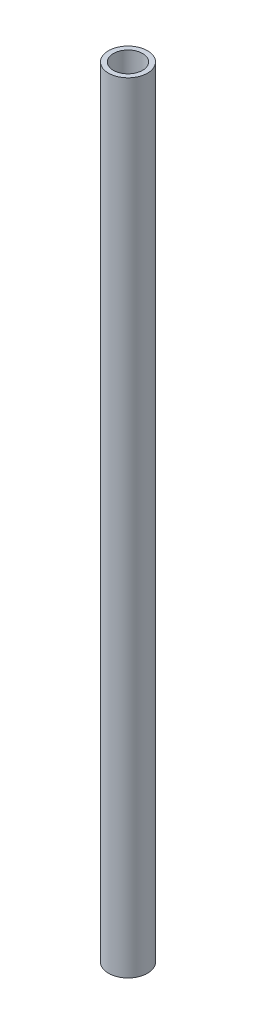
ISO-10303-21;
HEADER;
FILE_DESCRIPTION(('STEP AP214'),'2;1');
FILE_NAME('part.step','',(''),(''),'','','');
FILE_SCHEMA(('AUTOMOTIVE_DESIGN { 1 0 10303 214 1 1 1 1 }'));
ENDSEC;
DATA;
#1=APPLICATION_CONTEXT('core data for automotive mechanical design processes');
#2=APPLICATION_PROTOCOL_DEFINITION('international standard','automotive_design',2000,#1);
#3=PRODUCT_CONTEXT('',#1,'mechanical');
#4=PRODUCT('Part','Part','',(#3));
#5=PRODUCT_RELATED_PRODUCT_CATEGORY('part','',(#4));
#6=PRODUCT_DEFINITION_FORMATION('','',#4);
#7=PRODUCT_DEFINITION_CONTEXT('part definition',#1,'design');
#8=PRODUCT_DEFINITION('design','',#6,#7);
#9=PRODUCT_DEFINITION_SHAPE('','',#8);
#10=(LENGTH_UNIT() NAMED_UNIT(*) SI_UNIT(.MILLI.,.METRE.));
#11=(NAMED_UNIT(*) PLANE_ANGLE_UNIT() SI_UNIT($,.RADIAN.));
#12=(NAMED_UNIT(*) SI_UNIT($,.STERADIAN.) SOLID_ANGLE_UNIT());
#13=UNCERTAINTY_MEASURE_WITH_UNIT(LENGTH_MEASURE(1.E-05),#10,'distance_accuracy_value','');
#14=(GEOMETRIC_REPRESENTATION_CONTEXT(3) GLOBAL_UNCERTAINTY_ASSIGNED_CONTEXT((#13)) GLOBAL_UNIT_ASSIGNED_CONTEXT((#10,
#11,#12)) REPRESENTATION_CONTEXT('',''));
#15=CARTESIAN_POINT('',(0.,0.,0.));
#16=DIRECTION('',(0.,0.,1.));
#17=DIRECTION('',(1.,0.,0.));
#18=AXIS2_PLACEMENT_3D('',#15,#16,#17);
#19=CARTESIAN_POINT('',(0.,160.,0.));
#20=DIRECTION('',(0.,1.,0.));
#21=DIRECTION('',(0.,0.,1.));
#22=AXIS2_PLACEMENT_3D('',#19,#20,#21);
#23=PLANE('',#22);
#24=CARTESIAN_POINT('',(0.,160.,0.));
#25=DIRECTION('',(0.,1.,0.));
#26=DIRECTION('',(0.,0.,1.));
#27=AXIS2_PLACEMENT_3D('',#24,#25,#26);
#28=CIRCLE('',#27,4.);
#29=CARTESIAN_POINT('',(0.,160.,4.));
#30=VERTEX_POINT('',#29);
#31=EDGE_CURVE('E10',#30,#30,#28,.T.);
#32=ORIENTED_EDGE('',*,*,#31,.T.);
#33=EDGE_LOOP('',(#32));
#34=FACE_BOUND('',#33,.T.);
#35=CARTESIAN_POINT('',(0.,160.,0.));
#36=DIRECTION('',(0.,1.,0.));
#37=DIRECTION('',(0.,0.,1.));
#38=AXIS2_PLACEMENT_3D('',#35,#36,#37);
#39=CIRCLE('',#38,3.);
#40=CARTESIAN_POINT('',(0.,160.,3.));
#41=VERTEX_POINT('',#40);
#42=EDGE_CURVE('E42',#41,#41,#39,.T.);
#43=ORIENTED_EDGE('',*,*,#42,.F.);
#44=EDGE_LOOP('',(#43));
#45=FACE_BOUND('',#44,.T.);
#46=ADVANCED_FACE('F31',(#34,#45),#23,.T.);
#47=CARTESIAN_POINT('',(0.,0.,0.));
#48=DIRECTION('',(0.,1.,0.));
#49=DIRECTION('',(0.,0.,1.));
#50=AXIS2_PLACEMENT_3D('',#47,#48,#49);
#51=PLANE('',#50);
#52=CARTESIAN_POINT('',(0.,0.,0.));
#53=DIRECTION('',(0.,1.,0.));
#54=DIRECTION('',(0.,0.,1.));
#55=AXIS2_PLACEMENT_3D('',#52,#53,#54);
#56=CIRCLE('',#55,4.);
#57=CARTESIAN_POINT('',(0.,0.,4.));
#58=VERTEX_POINT('',#57);
#59=EDGE_CURVE('E35',#58,#58,#56,.T.);
#60=ORIENTED_EDGE('',*,*,#59,.F.);
#61=EDGE_LOOP('',(#60));
#62=FACE_BOUND('',#61,.T.);
#63=CARTESIAN_POINT('',(0.,0.,0.));
#64=DIRECTION('',(0.,1.,0.));
#65=DIRECTION('',(0.,0.,1.));
#66=AXIS2_PLACEMENT_3D('',#63,#64,#65);
#67=CIRCLE('',#66,3.);
#68=CARTESIAN_POINT('',(0.,0.,3.));
#69=VERTEX_POINT('',#68);
#70=EDGE_CURVE('E44',#69,#69,#67,.T.);
#71=ORIENTED_EDGE('',*,*,#70,.T.);
#72=EDGE_LOOP('',(#71));
#73=FACE_BOUND('',#72,.T.);
#74=ADVANCED_FACE('F54',(#62,#73),#51,.F.);
#75=CARTESIAN_POINT('',(0.,160.,0.));
#76=DIRECTION('',(0.,-1.,0.));
#77=DIRECTION('',(0.,0.,-1.));
#78=AXIS2_PLACEMENT_3D('',#75,#76,#77);
#79=CYLINDRICAL_SURFACE('',#78,4.);
#80=ORIENTED_EDGE('',*,*,#31,.F.);
#81=EDGE_LOOP('',(#80));
#82=FACE_BOUND('',#81,.T.);
#83=ORIENTED_EDGE('',*,*,#59,.T.);
#84=EDGE_LOOP('',(#83));
#85=FACE_BOUND('',#84,.T.);
#86=ADVANCED_FACE('F33',(#82,#85),#79,.T.);
#87=CARTESIAN_POINT('',(0.,160.,0.));
#88=DIRECTION('',(0.,-1.,0.));
#89=DIRECTION('',(0.,0.,-1.));
#90=AXIS2_PLACEMENT_3D('',#87,#88,#89);
#91=CYLINDRICAL_SURFACE('',#90,3.);
#92=ORIENTED_EDGE('',*,*,#42,.T.);
#93=EDGE_LOOP('',(#92));
#94=FACE_BOUND('',#93,.T.);
#95=ORIENTED_EDGE('',*,*,#70,.F.);
#96=EDGE_LOOP('',(#95));
#97=FACE_BOUND('',#96,.T.);
#98=ADVANCED_FACE('F50',(#94,#97),#91,.F.);
#99=CLOSED_SHELL('',(#46,#74,#86,#98));
#100=MANIFOLD_SOLID_BREP('B2',#99);
#101=ADVANCED_BREP_SHAPE_REPRESENTATION('',(#18,#100),#14);
#102=SHAPE_DEFINITION_REPRESENTATION(#9,#101);
ENDSEC;
END-ISO-10303-21;
